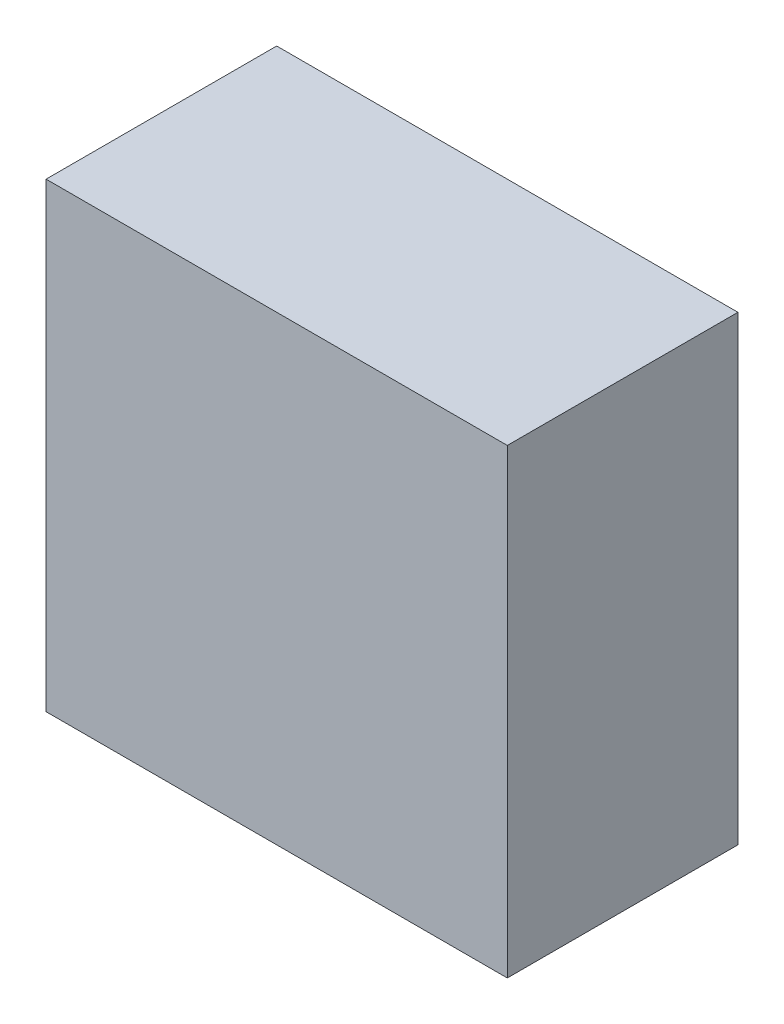
ISO-10303-21;
HEADER;
FILE_DESCRIPTION(('STEP AP214'),'2;1');
FILE_NAME('part.step','',(''),(''),'','','');
FILE_SCHEMA(('AUTOMOTIVE_DESIGN { 1 0 10303 214 1 1 1 1 }'));
ENDSEC;
DATA;
#1=APPLICATION_CONTEXT('core data for automotive mechanical design processes');
#2=APPLICATION_PROTOCOL_DEFINITION('international standard','automotive_design',2000,#1);
#3=PRODUCT_CONTEXT('',#1,'mechanical');
#4=PRODUCT('Part','Part','',(#3));
#5=PRODUCT_RELATED_PRODUCT_CATEGORY('part','',(#4));
#6=PRODUCT_DEFINITION_FORMATION('','',#4);
#7=PRODUCT_DEFINITION_CONTEXT('part definition',#1,'design');
#8=PRODUCT_DEFINITION('design','',#6,#7);
#9=PRODUCT_DEFINITION_SHAPE('','',#8);
#10=(LENGTH_UNIT() NAMED_UNIT(*) SI_UNIT(.MILLI.,.METRE.));
#11=(NAMED_UNIT(*) PLANE_ANGLE_UNIT() SI_UNIT($,.RADIAN.));
#12=(NAMED_UNIT(*) SI_UNIT($,.STERADIAN.) SOLID_ANGLE_UNIT());
#13=UNCERTAINTY_MEASURE_WITH_UNIT(LENGTH_MEASURE(1.E-05),#10,'distance_accuracy_value','');
#14=(GEOMETRIC_REPRESENTATION_CONTEXT(3) GLOBAL_UNCERTAINTY_ASSIGNED_CONTEXT((#13)) GLOBAL_UNIT_ASSIGNED_CONTEXT((#10,
#11,#12)) REPRESENTATION_CONTEXT('',''));
#15=CARTESIAN_POINT('',(0.,0.,0.));
#16=DIRECTION('',(0.,0.,1.));
#17=DIRECTION('',(1.,0.,0.));
#18=AXIS2_PLACEMENT_3D('',#15,#16,#17);
#19=CARTESIAN_POINT('',(0.,0.,2.75));
#20=DIRECTION('',(0.,0.,-1.));
#21=DIRECTION('',(-1.,0.,0.));
#22=AXIS2_PLACEMENT_3D('',#19,#20,#21);
#23=PLANE('',#22);
#24=DIRECTION('',(1.,0.,0.));
#25=VECTOR('',#24,1.);
#26=CARTESIAN_POINT('',(158.313158045852,-27.0708841556957,2.75));
#27=LINE('',#26,#25);
#28=CARTESIAN_POINT('',(158.313158045852,-27.0708841556957,2.75));
#29=VERTEX_POINT('',#28);
#30=CARTESIAN_POINT('',(154.313158045852,-27.0708841556957,2.75));
#31=VERTEX_POINT('',#30);
#32=EDGE_CURVE('E80',#29,#31,#27,.F.);
#33=ORIENTED_EDGE('',*,*,#32,.T.);
#34=DIRECTION('',(0.,1.,0.));
#35=VECTOR('',#34,1.);
#36=CARTESIAN_POINT('',(154.313158045852,-27.0708841556957,2.75));
#37=LINE('',#36,#35);
#38=CARTESIAN_POINT('',(154.313158045852,-31.0708841556957,2.75));
#39=VERTEX_POINT('',#38);
#40=EDGE_CURVE('E55',#31,#39,#37,.F.);
#41=ORIENTED_EDGE('',*,*,#40,.T.);
#42=DIRECTION('',(1.,0.,0.));
#43=VECTOR('',#42,1.);
#44=CARTESIAN_POINT('',(158.313158045852,-31.0708841556957,2.75));
#45=LINE('',#44,#43);
#46=CARTESIAN_POINT('',(158.313158045852,-31.0708841556957,2.75));
#47=VERTEX_POINT('',#46);
#48=EDGE_CURVE('E57',#39,#47,#45,.T.);
#49=ORIENTED_EDGE('',*,*,#48,.T.);
#50=DIRECTION('',(0.,1.,0.));
#51=VECTOR('',#50,1.);
#52=CARTESIAN_POINT('',(158.313158045852,-27.0708841556957,2.75));
#53=LINE('',#52,#51);
#54=EDGE_CURVE('E20',#47,#29,#53,.T.);
#55=ORIENTED_EDGE('',*,*,#54,.T.);
#56=EDGE_LOOP('',(#33,#41,#49,#55));
#57=FACE_BOUND('',#56,.T.);
#58=ADVANCED_FACE('F17',(#57),#23,.F.);
#59=CARTESIAN_POINT('',(158.313158045852,-27.0708841556957,2.75));
#60=DIRECTION('',(-1.,0.,0.));
#61=DIRECTION('',(0.,0.,1.));
#62=AXIS2_PLACEMENT_3D('',#59,#60,#61);
#63=PLANE('',#62);
#64=DIRECTION('',(0.,0.,-1.));
#65=VECTOR('',#64,1.);
#66=CARTESIAN_POINT('',(158.313158045852,-27.0708841556957,2.75));
#67=LINE('',#66,#65);
#68=CARTESIAN_POINT('',(158.313158045852,-27.0708841556957,0.75));
#69=VERTEX_POINT('',#68);
#70=EDGE_CURVE('E68',#69,#29,#67,.F.);
#71=ORIENTED_EDGE('',*,*,#70,.T.);
#72=ORIENTED_EDGE('',*,*,#54,.F.);
#73=DIRECTION('',(0.,0.,1.));
#74=VECTOR('',#73,1.);
#75=CARTESIAN_POINT('',(158.313158045852,-31.0708841556957,2.75));
#76=LINE('',#75,#74);
#77=CARTESIAN_POINT('',(158.313158045852,-31.0708841556957,0.75));
#78=VERTEX_POINT('',#77);
#79=EDGE_CURVE('E63',#47,#78,#76,.F.);
#80=ORIENTED_EDGE('',*,*,#79,.T.);
#81=DIRECTION('',(0.,1.,0.));
#82=VECTOR('',#81,1.);
#83=CARTESIAN_POINT('',(158.313158045852,0.,0.75));
#84=LINE('',#83,#82);
#85=EDGE_CURVE('E83',#69,#78,#84,.F.);
#86=ORIENTED_EDGE('',*,*,#85,.F.);
#87=EDGE_LOOP('',(#71,#72,#80,#86));
#88=FACE_BOUND('',#87,.T.);
#89=ADVANCED_FACE('F65',(#88),#63,.F.);
#90=CARTESIAN_POINT('',(158.313158045852,-31.0708841556957,2.75));
#91=DIRECTION('',(0.,1.,0.));
#92=DIRECTION('',(0.,0.,1.));
#93=AXIS2_PLACEMENT_3D('',#90,#91,#92);
#94=PLANE('',#93);
#95=ORIENTED_EDGE('',*,*,#79,.F.);
#96=ORIENTED_EDGE('',*,*,#48,.F.);
#97=DIRECTION('',(0.,0.,-1.));
#98=VECTOR('',#97,1.);
#99=CARTESIAN_POINT('',(154.313158045852,-31.0708841556957,2.75));
#100=LINE('',#99,#98);
#101=CARTESIAN_POINT('',(154.313158045852,-31.0708841556957,0.75));
#102=VERTEX_POINT('',#101);
#103=EDGE_CURVE('E75',#39,#102,#100,.T.);
#104=ORIENTED_EDGE('',*,*,#103,.T.);
#105=DIRECTION('',(-1.,0.,0.));
#106=VECTOR('',#105,1.);
#107=CARTESIAN_POINT('',(0.,-31.0708841556957,0.75));
#108=LINE('',#107,#106);
#109=EDGE_CURVE('E72',#78,#102,#108,.T.);
#110=ORIENTED_EDGE('',*,*,#109,.F.);
#111=EDGE_LOOP('',(#95,#96,#104,#110));
#112=FACE_BOUND('',#111,.T.);
#113=ADVANCED_FACE('F70',(#112),#94,.F.);
#114=CARTESIAN_POINT('',(154.313158045852,-27.0708841556957,2.75));
#115=DIRECTION('',(1.,0.,0.));
#116=DIRECTION('',(0.,0.,-1.));
#117=AXIS2_PLACEMENT_3D('',#114,#115,#116);
#118=PLANE('',#117);
#119=ORIENTED_EDGE('',*,*,#103,.F.);
#120=ORIENTED_EDGE('',*,*,#40,.F.);
#121=DIRECTION('',(0.,0.,-1.));
#122=VECTOR('',#121,1.);
#123=CARTESIAN_POINT('',(154.313158045852,-27.0708841556957,2.75));
#124=LINE('',#123,#122);
#125=CARTESIAN_POINT('',(154.313158045852,-27.0708841556957,0.75));
#126=VERTEX_POINT('',#125);
#127=EDGE_CURVE('E35',#31,#126,#124,.T.);
#128=ORIENTED_EDGE('',*,*,#127,.T.);
#129=DIRECTION('',(0.,1.,0.));
#130=VECTOR('',#129,1.);
#131=CARTESIAN_POINT('',(154.313158045852,0.,0.75));
#132=LINE('',#131,#130);
#133=EDGE_CURVE('E26',#102,#126,#132,.T.);
#134=ORIENTED_EDGE('',*,*,#133,.F.);
#135=EDGE_LOOP('',(#119,#120,#128,#134));
#136=FACE_BOUND('',#135,.T.);
#137=ADVANCED_FACE('F89',(#136),#118,.F.);
#138=CARTESIAN_POINT('',(158.313158045852,-27.0708841556957,2.75));
#139=DIRECTION('',(0.,-1.,0.));
#140=DIRECTION('',(0.,0.,-1.));
#141=AXIS2_PLACEMENT_3D('',#138,#139,#140);
#142=PLANE('',#141);
#143=ORIENTED_EDGE('',*,*,#127,.F.);
#144=ORIENTED_EDGE('',*,*,#32,.F.);
#145=ORIENTED_EDGE('',*,*,#70,.F.);
#146=DIRECTION('',(-1.,0.,0.));
#147=VECTOR('',#146,1.);
#148=CARTESIAN_POINT('',(0.,-27.0708841556957,0.75));
#149=LINE('',#148,#147);
#150=EDGE_CURVE('E11',#126,#69,#149,.F.);
#151=ORIENTED_EDGE('',*,*,#150,.F.);
#152=EDGE_LOOP('',(#143,#144,#145,#151));
#153=FACE_BOUND('',#152,.T.);
#154=ADVANCED_FACE('F91',(#153),#142,.F.);
#155=CARTESIAN_POINT('',(0.,0.,0.75));
#156=DIRECTION('',(0.,0.,-1.));
#157=DIRECTION('',(-1.,0.,0.));
#158=AXIS2_PLACEMENT_3D('',#155,#156,#157);
#159=PLANE('',#158);
#160=ORIENTED_EDGE('',*,*,#133,.T.);
#161=ORIENTED_EDGE('',*,*,#150,.T.);
#162=ORIENTED_EDGE('',*,*,#85,.T.);
#163=ORIENTED_EDGE('',*,*,#109,.T.);
#164=EDGE_LOOP('',(#160,#161,#162,#163));
#165=FACE_BOUND('',#164,.T.);
#166=ADVANCED_FACE('F88',(#165),#159,.T.);
#167=CLOSED_SHELL('',(#58,#89,#113,#137,#154,#166));
#168=MANIFOLD_SOLID_BREP('B1',#167);
#169=ADVANCED_BREP_SHAPE_REPRESENTATION('',(#18,#168),#14);
#170=SHAPE_DEFINITION_REPRESENTATION(#9,#169);
ENDSEC;
END-ISO-10303-21;
